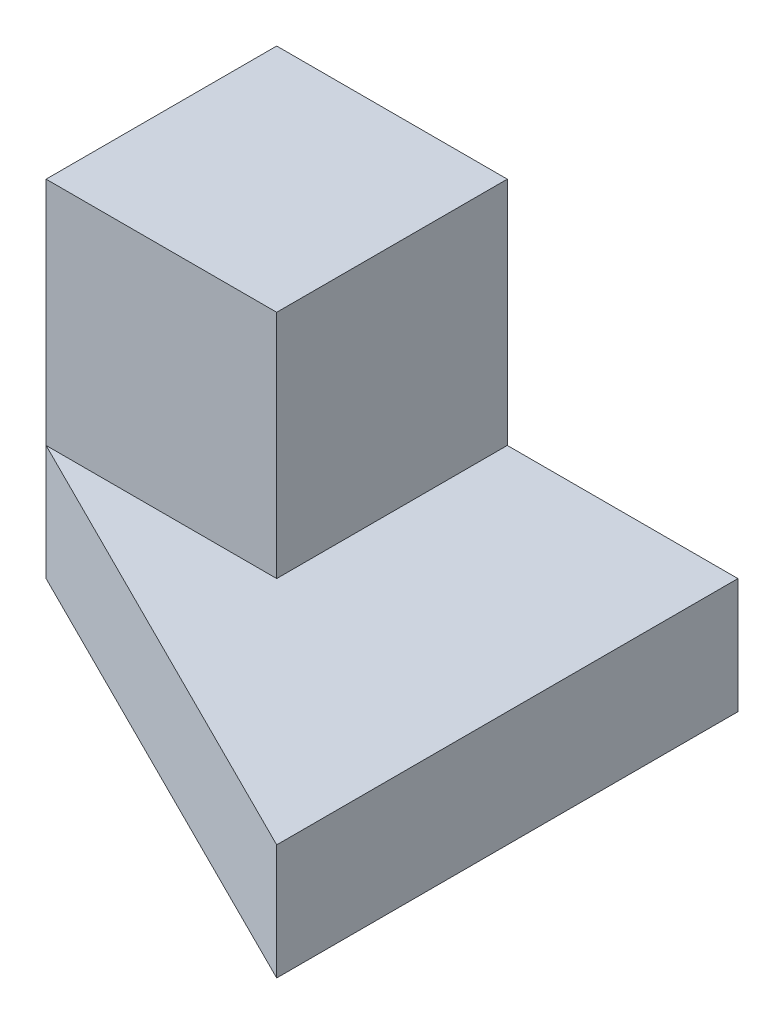
ISO-10303-21;
HEADER;
FILE_DESCRIPTION(('STEP AP214'),'2;1');
FILE_NAME('part.step','',(''),(''),'','','');
FILE_SCHEMA(('AUTOMOTIVE_DESIGN { 1 0 10303 214 1 1 1 1 }'));
ENDSEC;
DATA;
#1=APPLICATION_CONTEXT('core data for automotive mechanical design processes');
#2=APPLICATION_PROTOCOL_DEFINITION('international standard','automotive_design',2000,#1);
#3=PRODUCT_CONTEXT('',#1,'mechanical');
#4=PRODUCT('Part','Part','',(#3));
#5=PRODUCT_RELATED_PRODUCT_CATEGORY('part','',(#4));
#6=PRODUCT_DEFINITION_FORMATION('','',#4);
#7=PRODUCT_DEFINITION_CONTEXT('part definition',#1,'design');
#8=PRODUCT_DEFINITION('design','',#6,#7);
#9=PRODUCT_DEFINITION_SHAPE('','',#8);
#10=(LENGTH_UNIT() NAMED_UNIT(*) SI_UNIT(.MILLI.,.METRE.));
#11=(NAMED_UNIT(*) PLANE_ANGLE_UNIT() SI_UNIT($,.RADIAN.));
#12=(NAMED_UNIT(*) SI_UNIT($,.STERADIAN.) SOLID_ANGLE_UNIT());
#13=UNCERTAINTY_MEASURE_WITH_UNIT(LENGTH_MEASURE(1.E-05),#10,'distance_accuracy_value','');
#14=(GEOMETRIC_REPRESENTATION_CONTEXT(3) GLOBAL_UNCERTAINTY_ASSIGNED_CONTEXT((#13)) GLOBAL_UNIT_ASSIGNED_CONTEXT((#10,
#11,#12)) REPRESENTATION_CONTEXT('',''));
#15=CARTESIAN_POINT('',(0.,0.,0.));
#16=DIRECTION('',(0.,0.,1.));
#17=DIRECTION('',(1.,0.,0.));
#18=AXIS2_PLACEMENT_3D('',#15,#16,#17);
#19=CARTESIAN_POINT('',(-203.2,254.,406.4));
#20=DIRECTION('',(-0.447213595499958,0.,0.894427190999916));
#21=DIRECTION('',(0.894427190999916,0.,0.447213595499958));
#22=AXIS2_PLACEMENT_3D('',#19,#20,#21);
#23=PLANE('',#22);
#24=DIRECTION('',(-0.894427190999916,0.,-0.447213595499958));
#25=VECTOR('',#24,1.);
#26=CARTESIAN_POINT('',(-203.2,0.,406.4));
#27=LINE('',#26,#25);
#28=CARTESIAN_POINT('',(1016.,0.,1016.));
#29=VERTEX_POINT('',#28);
#30=CARTESIAN_POINT('',(0.,0.,508.));
#31=VERTEX_POINT('',#30);
#32=EDGE_CURVE('E112',#29,#31,#27,.T.);
#33=ORIENTED_EDGE('',*,*,#32,.F.);
#34=DIRECTION('',(0.,-1.,0.));
#35=VECTOR('',#34,1.);
#36=CARTESIAN_POINT('',(1016.,254.,1016.));
#37=LINE('',#36,#35);
#38=CARTESIAN_POINT('',(1016.,254.,1016.));
#39=VERTEX_POINT('',#38);
#40=EDGE_CURVE('E41',#39,#29,#37,.T.);
#41=ORIENTED_EDGE('',*,*,#40,.F.);
#42=DIRECTION('',(-0.894427190999916,0.,-0.447213595499958));
#43=VECTOR('',#42,1.);
#44=CARTESIAN_POINT('',(-203.2,254.,406.4));
#45=LINE('',#44,#43);
#46=CARTESIAN_POINT('',(0.,254.,508.));
#47=VERTEX_POINT('',#46);
#48=EDGE_CURVE('E125',#39,#47,#45,.T.);
#49=ORIENTED_EDGE('',*,*,#48,.T.);
#50=DIRECTION('',(0.,-1.,0.));
#51=VECTOR('',#50,1.);
#52=CARTESIAN_POINT('',(0.,254.,508.));
#53=LINE('',#52,#51);
#54=EDGE_CURVE('E11',#47,#31,#53,.T.);
#55=ORIENTED_EDGE('',*,*,#54,.T.);
#56=EDGE_LOOP('',(#33,#41,#49,#55));
#57=FACE_BOUND('',#56,.T.);
#58=ADVANCED_FACE('F33',(#57),#23,.T.);
#59=CARTESIAN_POINT('',(1016.,254.,-2.22044604925031E-13));
#60=DIRECTION('',(1.,0.,0.));
#61=DIRECTION('',(0.,0.,-1.));
#62=AXIS2_PLACEMENT_3D('',#59,#60,#61);
#63=PLANE('',#62);
#64=DIRECTION('',(0.,0.,1.));
#65=VECTOR('',#64,1.);
#66=CARTESIAN_POINT('',(1016.,0.,-2.22044604925031E-13));
#67=LINE('',#66,#65);
#68=CARTESIAN_POINT('',(1016.,0.,0.));
#69=VERTEX_POINT('',#68);
#70=EDGE_CURVE('E115',#69,#29,#67,.T.);
#71=ORIENTED_EDGE('',*,*,#70,.F.);
#72=DIRECTION('',(0.,-1.,0.));
#73=VECTOR('',#72,1.);
#74=CARTESIAN_POINT('',(1016.,254.,0.));
#75=LINE('',#74,#73);
#76=CARTESIAN_POINT('',(1016.,254.,0.));
#77=VERTEX_POINT('',#76);
#78=EDGE_CURVE('E49',#77,#69,#75,.T.);
#79=ORIENTED_EDGE('',*,*,#78,.F.);
#80=DIRECTION('',(0.,0.,1.));
#81=VECTOR('',#80,1.);
#82=CARTESIAN_POINT('',(1016.,254.,-2.22044604925031E-13));
#83=LINE('',#82,#81);
#84=EDGE_CURVE('E128',#77,#39,#83,.T.);
#85=ORIENTED_EDGE('',*,*,#84,.T.);
#86=ORIENTED_EDGE('',*,*,#40,.T.);
#87=EDGE_LOOP('',(#71,#79,#85,#86));
#88=FACE_BOUND('',#87,.T.);
#89=ADVANCED_FACE('F141',(#88),#63,.T.);
#90=CARTESIAN_POINT('',(0.,254.,0.));
#91=DIRECTION('',(0.,0.,-1.));
#92=DIRECTION('',(-1.,0.,0.));
#93=AXIS2_PLACEMENT_3D('',#90,#91,#92);
#94=PLANE('',#93);
#95=DIRECTION('',(1.,0.,0.));
#96=VECTOR('',#95,1.);
#97=CARTESIAN_POINT('',(0.,0.,0.));
#98=LINE('',#97,#96);
#99=CARTESIAN_POINT('',(0.,0.,0.));
#100=VERTEX_POINT('',#99);
#101=EDGE_CURVE('E123',#100,#69,#98,.T.);
#102=ORIENTED_EDGE('',*,*,#101,.F.);
#103=DIRECTION('',(0.,-1.,0.));
#104=VECTOR('',#103,1.);
#105=CARTESIAN_POINT('',(0.,762.,0.));
#106=LINE('',#105,#104);
#107=CARTESIAN_POINT('',(0.,762.,0.));
#108=VERTEX_POINT('',#107);
#109=EDGE_CURVE('E117',#108,#100,#106,.T.);
#110=ORIENTED_EDGE('',*,*,#109,.F.);
#111=DIRECTION('',(1.,0.,0.));
#112=VECTOR('',#111,1.);
#113=CARTESIAN_POINT('',(0.,762.,0.));
#114=LINE('',#113,#112);
#115=CARTESIAN_POINT('',(508.,762.,0.));
#116=VERTEX_POINT('',#115);
#117=EDGE_CURVE('E101',#108,#116,#114,.T.);
#118=ORIENTED_EDGE('',*,*,#117,.T.);
#119=DIRECTION('',(0.,-1.,0.));
#120=VECTOR('',#119,1.);
#121=CARTESIAN_POINT('',(508.,762.,0.));
#122=LINE('',#121,#120);
#123=CARTESIAN_POINT('',(508.,254.,0.));
#124=VERTEX_POINT('',#123);
#125=EDGE_CURVE('E97',#116,#124,#122,.T.);
#126=ORIENTED_EDGE('',*,*,#125,.T.);
#127=DIRECTION('',(1.,0.,0.));
#128=VECTOR('',#127,1.);
#129=CARTESIAN_POINT('',(0.,254.,0.));
#130=LINE('',#129,#128);
#131=EDGE_CURVE('E130',#124,#77,#130,.T.);
#132=ORIENTED_EDGE('',*,*,#131,.T.);
#133=ORIENTED_EDGE('',*,*,#78,.T.);
#134=EDGE_LOOP('',(#102,#110,#118,#126,#132,#133));
#135=FACE_BOUND('',#134,.T.);
#136=ADVANCED_FACE('F138',(#135),#94,.T.);
#137=CARTESIAN_POINT('',(0.,254.,0.));
#138=DIRECTION('',(0.,1.,0.));
#139=DIRECTION('',(0.,0.,1.));
#140=AXIS2_PLACEMENT_3D('',#137,#138,#139);
#141=PLANE('',#140);
#142=DIRECTION('',(0.,0.,-1.));
#143=VECTOR('',#142,1.);
#144=CARTESIAN_POINT('',(508.,254.,0.));
#145=LINE('',#144,#143);
#146=CARTESIAN_POINT('',(508.,254.,508.));
#147=VERTEX_POINT('',#146);
#148=EDGE_CURVE('E121',#147,#124,#145,.T.);
#149=ORIENTED_EDGE('',*,*,#148,.F.);
#150=DIRECTION('',(1.,0.,0.));
#151=VECTOR('',#150,1.);
#152=CARTESIAN_POINT('',(0.,254.,508.));
#153=LINE('',#152,#151);
#154=EDGE_CURVE('E64',#47,#147,#153,.T.);
#155=ORIENTED_EDGE('',*,*,#154,.F.);
#156=ORIENTED_EDGE('',*,*,#48,.F.);
#157=ORIENTED_EDGE('',*,*,#84,.F.);
#158=ORIENTED_EDGE('',*,*,#131,.F.);
#159=EDGE_LOOP('',(#149,#155,#156,#157,#158));
#160=FACE_BOUND('',#159,.T.);
#161=ADVANCED_FACE('F153',(#160),#141,.T.);
#162=CARTESIAN_POINT('',(0.,0.,0.));
#163=DIRECTION('',(0.,1.,0.));
#164=DIRECTION('',(0.,0.,1.));
#165=AXIS2_PLACEMENT_3D('',#162,#163,#164);
#166=PLANE('',#165);
#167=ORIENTED_EDGE('',*,*,#32,.T.);
#168=DIRECTION('',(0.,0.,-1.));
#169=VECTOR('',#168,1.);
#170=CARTESIAN_POINT('',(0.,0.,0.));
#171=LINE('',#170,#169);
#172=EDGE_CURVE('E109',#31,#100,#171,.T.);
#173=ORIENTED_EDGE('',*,*,#172,.T.);
#174=ORIENTED_EDGE('',*,*,#101,.T.);
#175=ORIENTED_EDGE('',*,*,#70,.T.);
#176=EDGE_LOOP('',(#167,#173,#174,#175));
#177=FACE_BOUND('',#176,.T.);
#178=ADVANCED_FACE('F144',(#177),#166,.F.);
#179=CARTESIAN_POINT('',(0.,762.,508.));
#180=DIRECTION('',(0.,0.,-1.));
#181=DIRECTION('',(-1.,0.,0.));
#182=AXIS2_PLACEMENT_3D('',#179,#180,#181);
#183=PLANE('',#182);
#184=ORIENTED_EDGE('',*,*,#154,.T.);
#185=DIRECTION('',(0.,-1.,0.));
#186=VECTOR('',#185,1.);
#187=CARTESIAN_POINT('',(508.,762.,508.));
#188=LINE('',#187,#186);
#189=CARTESIAN_POINT('',(508.,762.,508.));
#190=VERTEX_POINT('',#189);
#191=EDGE_CURVE('E94',#190,#147,#188,.T.);
#192=ORIENTED_EDGE('',*,*,#191,.F.);
#193=DIRECTION('',(1.,0.,0.));
#194=VECTOR('',#193,1.);
#195=CARTESIAN_POINT('',(0.,762.,508.));
#196=LINE('',#195,#194);
#197=CARTESIAN_POINT('',(0.,762.,508.));
#198=VERTEX_POINT('',#197);
#199=EDGE_CURVE('E102',#198,#190,#196,.T.);
#200=ORIENTED_EDGE('',*,*,#199,.F.);
#201=DIRECTION('',(0.,-1.,0.));
#202=VECTOR('',#201,1.);
#203=CARTESIAN_POINT('',(0.,762.,508.));
#204=LINE('',#203,#202);
#205=EDGE_CURVE('E150',#198,#47,#204,.T.);
#206=ORIENTED_EDGE('',*,*,#205,.T.);
#207=EDGE_LOOP('',(#184,#192,#200,#206));
#208=FACE_BOUND('',#207,.T.);
#209=ADVANCED_FACE('F111',(#208),#183,.F.);
#210=CARTESIAN_POINT('',(508.,762.,0.));
#211=DIRECTION('',(-1.,0.,0.));
#212=DIRECTION('',(0.,0.,1.));
#213=AXIS2_PLACEMENT_3D('',#210,#211,#212);
#214=PLANE('',#213);
#215=ORIENTED_EDGE('',*,*,#148,.T.);
#216=ORIENTED_EDGE('',*,*,#125,.F.);
#217=DIRECTION('',(0.,0.,-1.));
#218=VECTOR('',#217,1.);
#219=CARTESIAN_POINT('',(508.,762.,0.));
#220=LINE('',#219,#218);
#221=EDGE_CURVE('E91',#190,#116,#220,.T.);
#222=ORIENTED_EDGE('',*,*,#221,.F.);
#223=ORIENTED_EDGE('',*,*,#191,.T.);
#224=EDGE_LOOP('',(#215,#216,#222,#223));
#225=FACE_BOUND('',#224,.T.);
#226=ADVANCED_FACE('F93',(#225),#214,.F.);
#227=CARTESIAN_POINT('',(0.,762.,0.));
#228=DIRECTION('',(-1.,0.,0.));
#229=DIRECTION('',(0.,0.,1.));
#230=AXIS2_PLACEMENT_3D('',#227,#228,#229);
#231=PLANE('',#230);
#232=ORIENTED_EDGE('',*,*,#172,.F.);
#233=ORIENTED_EDGE('',*,*,#54,.F.);
#234=ORIENTED_EDGE('',*,*,#205,.F.);
#235=DIRECTION('',(0.,0.,-1.));
#236=VECTOR('',#235,1.);
#237=CARTESIAN_POINT('',(0.,762.,0.));
#238=LINE('',#237,#236);
#239=EDGE_CURVE('E108',#198,#108,#238,.T.);
#240=ORIENTED_EDGE('',*,*,#239,.T.);
#241=ORIENTED_EDGE('',*,*,#109,.T.);
#242=EDGE_LOOP('',(#232,#233,#234,#240,#241));
#243=FACE_BOUND('',#242,.T.);
#244=ADVANCED_FACE('F151',(#243),#231,.T.);
#245=CARTESIAN_POINT('',(0.,762.,0.));
#246=DIRECTION('',(0.,1.,0.));
#247=DIRECTION('',(0.,0.,1.));
#248=AXIS2_PLACEMENT_3D('',#245,#246,#247);
#249=PLANE('',#248);
#250=ORIENTED_EDGE('',*,*,#199,.T.);
#251=ORIENTED_EDGE('',*,*,#221,.T.);
#252=ORIENTED_EDGE('',*,*,#117,.F.);
#253=ORIENTED_EDGE('',*,*,#239,.F.);
#254=EDGE_LOOP('',(#250,#251,#252,#253));
#255=FACE_BOUND('',#254,.T.);
#256=ADVANCED_FACE('F106',(#255),#249,.T.);
#257=CLOSED_SHELL('',(#58,#89,#136,#161,#178,#209,#226,#244,#256));
#258=MANIFOLD_SOLID_BREP('B2',#257);
#259=ADVANCED_BREP_SHAPE_REPRESENTATION('',(#18,#258),#14);
#260=SHAPE_DEFINITION_REPRESENTATION(#9,#259);
ENDSEC;
END-ISO-10303-21;
